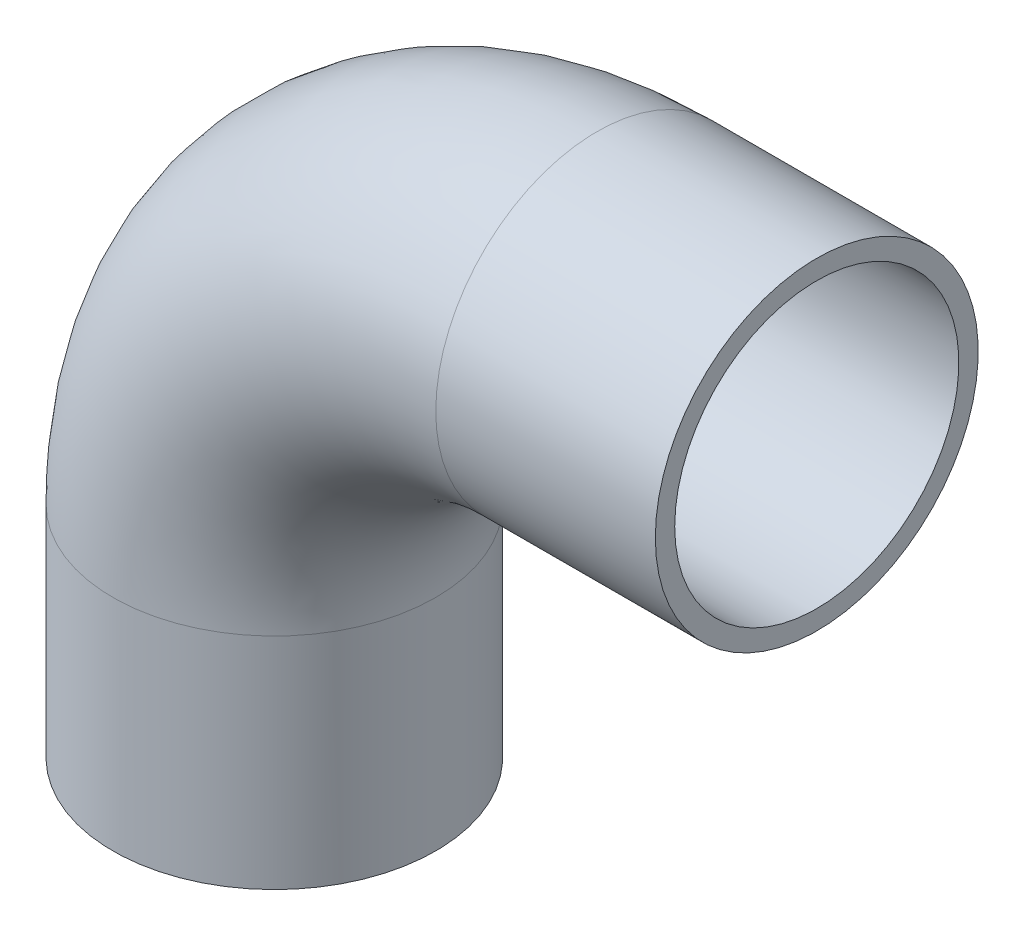
ISO-10303-21;
HEADER;
FILE_DESCRIPTION(('STEP AP214'),'2;1');
FILE_NAME('part.step','',(''),(''),'','','');
FILE_SCHEMA(('AUTOMOTIVE_DESIGN { 1 0 10303 214 1 1 1 1 }'));
ENDSEC;
DATA;
#1=APPLICATION_CONTEXT('core data for automotive mechanical design processes');
#2=APPLICATION_PROTOCOL_DEFINITION('international standard','automotive_design',2000,#1);
#3=PRODUCT_CONTEXT('',#1,'mechanical');
#4=PRODUCT('Part','Part','',(#3));
#5=PRODUCT_RELATED_PRODUCT_CATEGORY('part','',(#4));
#6=PRODUCT_DEFINITION_FORMATION('','',#4);
#7=PRODUCT_DEFINITION_CONTEXT('part definition',#1,'design');
#8=PRODUCT_DEFINITION('design','',#6,#7);
#9=PRODUCT_DEFINITION_SHAPE('','',#8);
#10=(LENGTH_UNIT() NAMED_UNIT(*) SI_UNIT(.MILLI.,.METRE.));
#11=(NAMED_UNIT(*) PLANE_ANGLE_UNIT() SI_UNIT($,.RADIAN.));
#12=(NAMED_UNIT(*) SI_UNIT($,.STERADIAN.) SOLID_ANGLE_UNIT());
#13=UNCERTAINTY_MEASURE_WITH_UNIT(LENGTH_MEASURE(1.E-05),#10,'distance_accuracy_value','');
#14=(GEOMETRIC_REPRESENTATION_CONTEXT(3) GLOBAL_UNCERTAINTY_ASSIGNED_CONTEXT((#13)) GLOBAL_UNIT_ASSIGNED_CONTEXT((#10,
#11,#12)) REPRESENTATION_CONTEXT('',''));
#15=CARTESIAN_POINT('',(0.,0.,0.));
#16=DIRECTION('',(0.,0.,1.));
#17=DIRECTION('',(1.,0.,0.));
#18=AXIS2_PLACEMENT_3D('',#15,#16,#17);
#19=CARTESIAN_POINT('',(50.,34.,0.));
#20=DIRECTION('',(0.,0.,1.));
#21=DIRECTION('',(1.,0.,0.));
#22=AXIS2_PLACEMENT_3D('',#19,#20,#21);
#23=TOROIDAL_SURFACE('',#22,50.,22.);
#24=CARTESIAN_POINT('',(50.,84.,0.));
#25=DIRECTION('',(-1.,0.,0.));
#26=DIRECTION('',(0.,1.,0.));
#27=AXIS2_PLACEMENT_3D('',#24,#25,#26);
#28=CIRCLE('',#27,22.);
#29=CARTESIAN_POINT('',(50.,106.,0.));
#30=VERTEX_POINT('',#29);
#31=EDGE_CURVE('E33',#30,#30,#28,.T.);
#32=ORIENTED_EDGE('',*,*,#31,.F.);
#33=EDGE_LOOP('',(#32));
#34=FACE_BOUND('',#33,.T.);
#35=CARTESIAN_POINT('',(0.,34.,0.));
#36=DIRECTION('',(0.,-1.,0.));
#37=DIRECTION('',(-1.,0.,0.));
#38=AXIS2_PLACEMENT_3D('',#35,#36,#37);
#39=CIRCLE('',#38,22.);
#40=CARTESIAN_POINT('',(-22.,34.,0.));
#41=VERTEX_POINT('',#40);
#42=EDGE_CURVE('E31',#41,#41,#39,.F.);
#43=ORIENTED_EDGE('',*,*,#42,.F.);
#44=EDGE_LOOP('',(#43));
#45=FACE_BOUND('',#44,.T.);
#46=ADVANCED_FACE('F13',(#34,#45),#23,.F.);
#47=CARTESIAN_POINT('',(84.,84.,0.));
#48=DIRECTION('',(-1.,0.,0.));
#49=DIRECTION('',(0.,0.,1.));
#50=AXIS2_PLACEMENT_3D('',#47,#48,#49);
#51=CYLINDRICAL_SURFACE('',#50,22.);
#52=CARTESIAN_POINT('',(84.,84.,0.));
#53=DIRECTION('',(-1.,0.,0.));
#54=DIRECTION('',(0.,0.,1.));
#55=AXIS2_PLACEMENT_3D('',#52,#53,#54);
#56=CIRCLE('',#55,22.);
#57=CARTESIAN_POINT('',(84.,84.,22.));
#58=VERTEX_POINT('',#57);
#59=EDGE_CURVE('E17',#58,#58,#56,.T.);
#60=ORIENTED_EDGE('',*,*,#59,.F.);
#61=EDGE_LOOP('',(#60));
#62=FACE_BOUND('',#61,.T.);
#63=ORIENTED_EDGE('',*,*,#31,.T.);
#64=EDGE_LOOP('',(#63));
#65=FACE_BOUND('',#64,.T.);
#66=ADVANCED_FACE('F52',(#62,#65),#51,.F.);
#67=CARTESIAN_POINT('',(0.,34.,0.));
#68=DIRECTION('',(0.,-1.,0.));
#69=DIRECTION('',(0.,0.,-1.));
#70=AXIS2_PLACEMENT_3D('',#67,#68,#69);
#71=CYLINDRICAL_SURFACE('',#70,22.);
#72=ORIENTED_EDGE('',*,*,#42,.T.);
#73=EDGE_LOOP('',(#72));
#74=FACE_BOUND('',#73,.T.);
#75=CARTESIAN_POINT('',(0.,0.,0.));
#76=DIRECTION('',(0.,-1.,0.));
#77=DIRECTION('',(0.,0.,-1.));
#78=AXIS2_PLACEMENT_3D('',#75,#76,#77);
#79=CIRCLE('',#78,22.);
#80=CARTESIAN_POINT('',(0.,0.,-22.));
#81=VERTEX_POINT('',#80);
#82=EDGE_CURVE('E42',#81,#81,#79,.F.);
#83=ORIENTED_EDGE('',*,*,#82,.F.);
#84=EDGE_LOOP('',(#83));
#85=FACE_BOUND('',#84,.T.);
#86=ADVANCED_FACE('F55',(#74,#85),#71,.F.);
#87=CARTESIAN_POINT('',(84.,109.,25.3000021083545));
#88=DIRECTION('',(1.,0.,0.));
#89=DIRECTION('',(0.,-1.,0.));
#90=AXIS2_PLACEMENT_3D('',#87,#88,#89);
#91=PLANE('',#90);
#92=ORIENTED_EDGE('',*,*,#59,.T.);
#93=EDGE_LOOP('',(#92));
#94=FACE_BOUND('',#93,.T.);
#95=CARTESIAN_POINT('',(84.,84.,0.));
#96=DIRECTION('',(-1.,0.,0.));
#97=DIRECTION('',(0.,0.,1.));
#98=AXIS2_PLACEMENT_3D('',#95,#96,#97);
#99=CIRCLE('',#98,25.);
#100=CARTESIAN_POINT('',(84.,84.,25.));
#101=VERTEX_POINT('',#100);
#102=EDGE_CURVE('E40',#101,#101,#99,.T.);
#103=ORIENTED_EDGE('',*,*,#102,.F.);
#104=EDGE_LOOP('',(#103));
#105=FACE_BOUND('',#104,.T.);
#106=ADVANCED_FACE('F49',(#94,#105),#91,.T.);
#107=CARTESIAN_POINT('',(25.,0.,25.3000021083545));
#108=DIRECTION('',(0.,-1.,0.));
#109=DIRECTION('',(-1.,0.,0.));
#110=AXIS2_PLACEMENT_3D('',#107,#108,#109);
#111=PLANE('',#110);
#112=ORIENTED_EDGE('',*,*,#82,.T.);
#113=EDGE_LOOP('',(#112));
#114=FACE_BOUND('',#113,.T.);
#115=CARTESIAN_POINT('',(0.,0.,0.));
#116=DIRECTION('',(0.,-1.,0.));
#117=DIRECTION('',(0.,0.,-1.));
#118=AXIS2_PLACEMENT_3D('',#115,#116,#117);
#119=CIRCLE('',#118,25.);
#120=CARTESIAN_POINT('',(0.,0.,-25.));
#121=VERTEX_POINT('',#120);
#122=EDGE_CURVE('E26',#121,#121,#119,.F.);
#123=ORIENTED_EDGE('',*,*,#122,.F.);
#124=EDGE_LOOP('',(#123));
#125=FACE_BOUND('',#124,.T.);
#126=ADVANCED_FACE('F69',(#114,#125),#111,.T.);
#127=CARTESIAN_POINT('',(50.,84.,0.));
#128=DIRECTION('',(-1.,0.,0.));
#129=DIRECTION('',(0.,0.,1.));
#130=AXIS2_PLACEMENT_3D('',#127,#128,#129);
#131=CYLINDRICAL_SURFACE('',#130,25.);
#132=ORIENTED_EDGE('',*,*,#102,.T.);
#133=EDGE_LOOP('',(#132));
#134=FACE_BOUND('',#133,.T.);
#135=CARTESIAN_POINT('',(50.,84.,0.));
#136=DIRECTION('',(-1.,0.,0.));
#137=DIRECTION('',(0.,-1.,0.));
#138=AXIS2_PLACEMENT_3D('',#135,#136,#137);
#139=CIRCLE('',#138,25.);
#140=CARTESIAN_POINT('',(50.,59.,0.));
#141=VERTEX_POINT('',#140);
#142=EDGE_CURVE('E21',#141,#141,#139,.T.);
#143=ORIENTED_EDGE('',*,*,#142,.F.);
#144=EDGE_LOOP('',(#143));
#145=FACE_BOUND('',#144,.T.);
#146=ADVANCED_FACE('F79',(#134,#145),#131,.T.);
#147=CARTESIAN_POINT('',(0.,0.,0.));
#148=DIRECTION('',(0.,-1.,0.));
#149=DIRECTION('',(0.,0.,-1.));
#150=AXIS2_PLACEMENT_3D('',#147,#148,#149);
#151=CYLINDRICAL_SURFACE('',#150,25.);
#152=CARTESIAN_POINT('',(0.,34.,0.));
#153=DIRECTION('',(0.,-1.,0.));
#154=DIRECTION('',(1.,0.,0.));
#155=AXIS2_PLACEMENT_3D('',#152,#153,#154);
#156=CIRCLE('',#155,25.);
#157=CARTESIAN_POINT('',(25.,34.,0.));
#158=VERTEX_POINT('',#157);
#159=EDGE_CURVE('E8',#158,#158,#156,.F.);
#160=ORIENTED_EDGE('',*,*,#159,.F.);
#161=EDGE_LOOP('',(#160));
#162=FACE_BOUND('',#161,.T.);
#163=ORIENTED_EDGE('',*,*,#122,.T.);
#164=EDGE_LOOP('',(#163));
#165=FACE_BOUND('',#164,.T.);
#166=ADVANCED_FACE('F73',(#162,#165),#151,.T.);
#167=CARTESIAN_POINT('',(50.,34.,0.));
#168=DIRECTION('',(0.,0.,1.));
#169=DIRECTION('',(1.,0.,0.));
#170=AXIS2_PLACEMENT_3D('',#167,#168,#169);
#171=TOROIDAL_SURFACE('',#170,50.,25.);
#172=ORIENTED_EDGE('',*,*,#142,.T.);
#173=EDGE_LOOP('',(#172));
#174=FACE_BOUND('',#173,.T.);
#175=ORIENTED_EDGE('',*,*,#159,.T.);
#176=EDGE_LOOP('',(#175));
#177=FACE_BOUND('',#176,.T.);
#178=ADVANCED_FACE('F71',(#174,#177),#171,.T.);
#179=CLOSED_SHELL('',(#46,#66,#86,#106,#126,#146,#166,#178));
#180=MANIFOLD_SOLID_BREP('B1',#179);
#181=ADVANCED_BREP_SHAPE_REPRESENTATION('',(#18,#180),#14);
#182=SHAPE_DEFINITION_REPRESENTATION(#9,#181);
ENDSEC;
END-ISO-10303-21;
